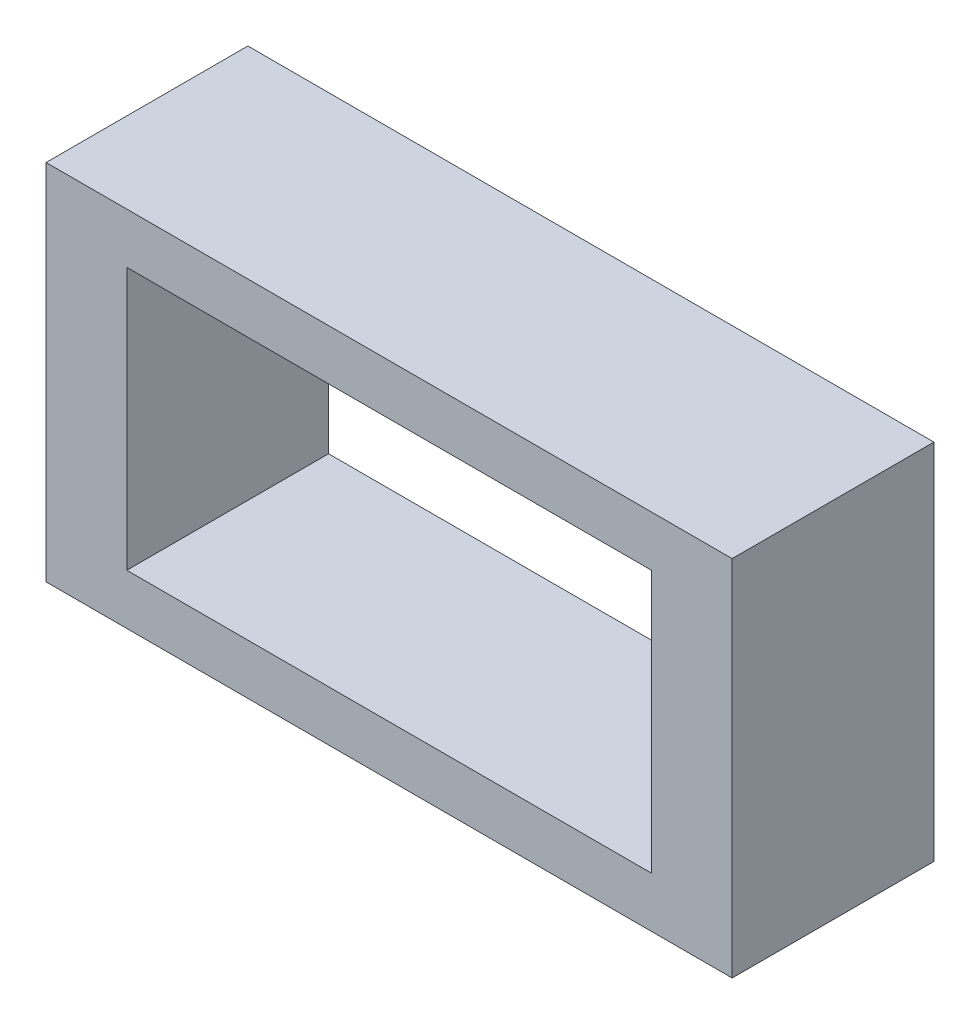
ISO-10303-21;
HEADER;
FILE_DESCRIPTION(('STEP AP214'),'2;1');
FILE_NAME('part.step','',(''),(''),'','','');
FILE_SCHEMA(('AUTOMOTIVE_DESIGN { 1 0 10303 214 1 1 1 1 }'));
ENDSEC;
DATA;
#1=APPLICATION_CONTEXT('core data for automotive mechanical design processes');
#2=APPLICATION_PROTOCOL_DEFINITION('international standard','automotive_design',2000,#1);
#3=PRODUCT_CONTEXT('',#1,'mechanical');
#4=PRODUCT('Part','Part','',(#3));
#5=PRODUCT_RELATED_PRODUCT_CATEGORY('part','',(#4));
#6=PRODUCT_DEFINITION_FORMATION('','',#4);
#7=PRODUCT_DEFINITION_CONTEXT('part definition',#1,'design');
#8=PRODUCT_DEFINITION('design','',#6,#7);
#9=PRODUCT_DEFINITION_SHAPE('','',#8);
#10=(LENGTH_UNIT() NAMED_UNIT(*) SI_UNIT(.MILLI.,.METRE.));
#11=(NAMED_UNIT(*) PLANE_ANGLE_UNIT() SI_UNIT($,.RADIAN.));
#12=(NAMED_UNIT(*) SI_UNIT($,.STERADIAN.) SOLID_ANGLE_UNIT());
#13=UNCERTAINTY_MEASURE_WITH_UNIT(LENGTH_MEASURE(1.E-05),#10,'distance_accuracy_value','');
#14=(GEOMETRIC_REPRESENTATION_CONTEXT(3) GLOBAL_UNCERTAINTY_ASSIGNED_CONTEXT((#13)) GLOBAL_UNIT_ASSIGNED_CONTEXT((#10,
#11,#12)) REPRESENTATION_CONTEXT('',''));
#15=CARTESIAN_POINT('',(0.,0.,0.));
#16=DIRECTION('',(0.,0.,1.));
#17=DIRECTION('',(1.,0.,0.));
#18=AXIS2_PLACEMENT_3D('',#15,#16,#17);
#19=CARTESIAN_POINT('',(8.5,4.5,5.));
#20=DIRECTION('',(-1.,0.,0.));
#21=DIRECTION('',(0.,-1.,0.));
#22=AXIS2_PLACEMENT_3D('',#19,#20,#21);
#23=PLANE('',#22);
#24=DIRECTION('',(0.,1.,0.));
#25=VECTOR('',#24,1.);
#26=CARTESIAN_POINT('',(8.5,4.5,0.));
#27=LINE('',#26,#25);
#28=CARTESIAN_POINT('',(8.50000000000001,-4.5,0.));
#29=VERTEX_POINT('',#28);
#30=CARTESIAN_POINT('',(8.5,4.5,0.));
#31=VERTEX_POINT('',#30);
#32=EDGE_CURVE('E129',#29,#31,#27,.T.);
#33=ORIENTED_EDGE('',*,*,#32,.T.);
#34=DIRECTION('',(0.,0.,-1.));
#35=VECTOR('',#34,1.);
#36=CARTESIAN_POINT('',(8.5,4.5,5.));
#37=LINE('',#36,#35);
#38=CARTESIAN_POINT('',(8.5,4.5,5.));
#39=VERTEX_POINT('',#38);
#40=EDGE_CURVE('E11',#39,#31,#37,.T.);
#41=ORIENTED_EDGE('',*,*,#40,.F.);
#42=DIRECTION('',(0.,1.,0.));
#43=VECTOR('',#42,1.);
#44=CARTESIAN_POINT('',(8.5,4.5,5.));
#45=LINE('',#44,#43);
#46=CARTESIAN_POINT('',(8.50000000000001,-4.5,5.));
#47=VERTEX_POINT('',#46);
#48=EDGE_CURVE('E131',#47,#39,#45,.T.);
#49=ORIENTED_EDGE('',*,*,#48,.F.);
#50=DIRECTION('',(0.,0.,-1.));
#51=VECTOR('',#50,1.);
#52=CARTESIAN_POINT('',(8.50000000000001,-4.5,5.));
#53=LINE('',#52,#51);
#54=EDGE_CURVE('E141',#47,#29,#53,.T.);
#55=ORIENTED_EDGE('',*,*,#54,.T.);
#56=EDGE_LOOP('',(#33,#41,#49,#55));
#57=FACE_BOUND('',#56,.T.);
#58=ADVANCED_FACE('F35',(#57),#23,.F.);
#59=CARTESIAN_POINT('',(-8.5,4.5,5.));
#60=DIRECTION('',(0.,-1.,0.));
#61=DIRECTION('',(0.,0.,-1.));
#62=AXIS2_PLACEMENT_3D('',#59,#60,#61);
#63=PLANE('',#62);
#64=DIRECTION('',(-1.,0.,0.));
#65=VECTOR('',#64,1.);
#66=CARTESIAN_POINT('',(-8.5,4.5,0.));
#67=LINE('',#66,#65);
#68=CARTESIAN_POINT('',(-8.5,4.5,0.));
#69=VERTEX_POINT('',#68);
#70=EDGE_CURVE('E144',#31,#69,#67,.T.);
#71=ORIENTED_EDGE('',*,*,#70,.T.);
#72=DIRECTION('',(0.,0.,-1.));
#73=VECTOR('',#72,1.);
#74=CARTESIAN_POINT('',(-8.5,4.5,5.));
#75=LINE('',#74,#73);
#76=CARTESIAN_POINT('',(-8.5,4.5,5.));
#77=VERTEX_POINT('',#76);
#78=EDGE_CURVE('E42',#77,#69,#75,.T.);
#79=ORIENTED_EDGE('',*,*,#78,.F.);
#80=DIRECTION('',(-1.,0.,0.));
#81=VECTOR('',#80,1.);
#82=CARTESIAN_POINT('',(-8.5,4.5,5.));
#83=LINE('',#82,#81);
#84=EDGE_CURVE('E134',#39,#77,#83,.T.);
#85=ORIENTED_EDGE('',*,*,#84,.F.);
#86=ORIENTED_EDGE('',*,*,#40,.T.);
#87=EDGE_LOOP('',(#71,#79,#85,#86));
#88=FACE_BOUND('',#87,.T.);
#89=ADVANCED_FACE('F172',(#88),#63,.F.);
#90=CARTESIAN_POINT('',(-8.5,4.5,5.));
#91=DIRECTION('',(1.,0.,0.));
#92=DIRECTION('',(0.,1.,0.));
#93=AXIS2_PLACEMENT_3D('',#90,#91,#92);
#94=PLANE('',#93);
#95=DIRECTION('',(0.,-1.,0.));
#96=VECTOR('',#95,1.);
#97=CARTESIAN_POINT('',(-8.5,4.5,0.));
#98=LINE('',#97,#96);
#99=CARTESIAN_POINT('',(-8.49999999999999,-4.5,0.));
#100=VERTEX_POINT('',#99);
#101=EDGE_CURVE('E146',#69,#100,#98,.T.);
#102=ORIENTED_EDGE('',*,*,#101,.T.);
#103=DIRECTION('',(0.,0.,-1.));
#104=VECTOR('',#103,1.);
#105=CARTESIAN_POINT('',(-8.49999999999999,-4.5,5.));
#106=LINE('',#105,#104);
#107=CARTESIAN_POINT('',(-8.49999999999999,-4.5,5.));
#108=VERTEX_POINT('',#107);
#109=EDGE_CURVE('E151',#108,#100,#106,.T.);
#110=ORIENTED_EDGE('',*,*,#109,.F.);
#111=DIRECTION('',(0.,-1.,0.));
#112=VECTOR('',#111,1.);
#113=CARTESIAN_POINT('',(-8.5,4.5,5.));
#114=LINE('',#113,#112);
#115=EDGE_CURVE('E137',#77,#108,#114,.T.);
#116=ORIENTED_EDGE('',*,*,#115,.F.);
#117=ORIENTED_EDGE('',*,*,#78,.T.);
#118=EDGE_LOOP('',(#102,#110,#116,#117));
#119=FACE_BOUND('',#118,.T.);
#120=ADVANCED_FACE('F158',(#119),#94,.F.);
#121=CARTESIAN_POINT('',(-8.49999999999999,-4.5,5.));
#122=DIRECTION('',(0.,1.,0.));
#123=DIRECTION('',(0.,0.,1.));
#124=AXIS2_PLACEMENT_3D('',#121,#122,#123);
#125=PLANE('',#124);
#126=DIRECTION('',(1.,0.,0.));
#127=VECTOR('',#126,1.);
#128=CARTESIAN_POINT('',(-8.49999999999999,-4.5,0.));
#129=LINE('',#128,#127);
#130=EDGE_CURVE('E135',#100,#29,#129,.T.);
#131=ORIENTED_EDGE('',*,*,#130,.T.);
#132=ORIENTED_EDGE('',*,*,#54,.F.);
#133=DIRECTION('',(1.,0.,0.));
#134=VECTOR('',#133,1.);
#135=CARTESIAN_POINT('',(-8.49999999999999,-4.5,5.));
#136=LINE('',#135,#134);
#137=EDGE_CURVE('E139',#108,#47,#136,.T.);
#138=ORIENTED_EDGE('',*,*,#137,.F.);
#139=ORIENTED_EDGE('',*,*,#109,.T.);
#140=EDGE_LOOP('',(#131,#132,#138,#139));
#141=FACE_BOUND('',#140,.T.);
#142=ADVANCED_FACE('F167',(#141),#125,.F.);
#143=CARTESIAN_POINT('',(0.,0.,5.));
#144=DIRECTION('',(0.,0.,1.));
#145=DIRECTION('',(1.,0.,0.));
#146=AXIS2_PLACEMENT_3D('',#143,#144,#145);
#147=PLANE('',#146);
#148=DIRECTION('',(0.,-1.,0.));
#149=VECTOR('',#148,1.);
#150=CARTESIAN_POINT('',(-6.5,3.25,5.));
#151=LINE('',#150,#149);
#152=CARTESIAN_POINT('',(-6.5,3.25,5.));
#153=VERTEX_POINT('',#152);
#154=CARTESIAN_POINT('',(-6.5,-3.25,5.));
#155=VERTEX_POINT('',#154);
#156=EDGE_CURVE('E49',#153,#155,#151,.T.);
#157=ORIENTED_EDGE('',*,*,#156,.F.);
#158=DIRECTION('',(1.,0.,0.));
#159=VECTOR('',#158,1.);
#160=CARTESIAN_POINT('',(-6.5,3.25,5.));
#161=LINE('',#160,#159);
#162=CARTESIAN_POINT('',(6.5,3.25,5.));
#163=VERTEX_POINT('',#162);
#164=EDGE_CURVE('E118',#153,#163,#161,.T.);
#165=ORIENTED_EDGE('',*,*,#164,.T.);
#166=DIRECTION('',(0.,-1.,0.));
#167=VECTOR('',#166,1.);
#168=CARTESIAN_POINT('',(6.5,3.25,5.));
#169=LINE('',#168,#167);
#170=CARTESIAN_POINT('',(6.5,-3.25,5.));
#171=VERTEX_POINT('',#170);
#172=EDGE_CURVE('E102',#163,#171,#169,.T.);
#173=ORIENTED_EDGE('',*,*,#172,.T.);
#174=DIRECTION('',(1.,0.,0.));
#175=VECTOR('',#174,1.);
#176=CARTESIAN_POINT('',(-6.5,-3.25,5.));
#177=LINE('',#176,#175);
#178=EDGE_CURVE('E111',#155,#171,#177,.T.);
#179=ORIENTED_EDGE('',*,*,#178,.F.);
#180=EDGE_LOOP('',(#157,#165,#173,#179));
#181=FACE_BOUND('',#180,.T.);
#182=ORIENTED_EDGE('',*,*,#48,.T.);
#183=ORIENTED_EDGE('',*,*,#84,.T.);
#184=ORIENTED_EDGE('',*,*,#115,.T.);
#185=ORIENTED_EDGE('',*,*,#137,.T.);
#186=EDGE_LOOP('',(#182,#183,#184,#185));
#187=FACE_BOUND('',#186,.T.);
#188=ADVANCED_FACE('F115',(#181,#187),#147,.T.);
#189=CARTESIAN_POINT('',(0.,0.,0.));
#190=DIRECTION('',(0.,0.,1.));
#191=DIRECTION('',(1.,0.,0.));
#192=AXIS2_PLACEMENT_3D('',#189,#190,#191);
#193=PLANE('',#192);
#194=DIRECTION('',(-1.,0.,0.));
#195=VECTOR('',#194,1.);
#196=CARTESIAN_POINT('',(-6.5,3.25,0.));
#197=LINE('',#196,#195);
#198=CARTESIAN_POINT('',(6.5,3.25,0.));
#199=VERTEX_POINT('',#198);
#200=CARTESIAN_POINT('',(-6.5,3.25,0.));
#201=VERTEX_POINT('',#200);
#202=EDGE_CURVE('E201',#199,#201,#197,.T.);
#203=ORIENTED_EDGE('',*,*,#202,.T.);
#204=DIRECTION('',(0.,1.,0.));
#205=VECTOR('',#204,1.);
#206=CARTESIAN_POINT('',(-6.5,3.25,0.));
#207=LINE('',#206,#205);
#208=CARTESIAN_POINT('',(-6.5,-3.25,0.));
#209=VERTEX_POINT('',#208);
#210=EDGE_CURVE('E130',#209,#201,#207,.T.);
#211=ORIENTED_EDGE('',*,*,#210,.F.);
#212=DIRECTION('',(-1.,0.,0.));
#213=VECTOR('',#212,1.);
#214=CARTESIAN_POINT('',(-6.5,-3.25,0.));
#215=LINE('',#214,#213);
#216=CARTESIAN_POINT('',(6.5,-3.25,0.));
#217=VERTEX_POINT('',#216);
#218=EDGE_CURVE('E127',#217,#209,#215,.T.);
#219=ORIENTED_EDGE('',*,*,#218,.F.);
#220=DIRECTION('',(0.,1.,0.));
#221=VECTOR('',#220,1.);
#222=CARTESIAN_POINT('',(6.5,3.25,0.));
#223=LINE('',#222,#221);
#224=EDGE_CURVE('E105',#217,#199,#223,.T.);
#225=ORIENTED_EDGE('',*,*,#224,.T.);
#226=EDGE_LOOP('',(#203,#211,#219,#225));
#227=FACE_BOUND('',#226,.T.);
#228=ORIENTED_EDGE('',*,*,#32,.F.);
#229=ORIENTED_EDGE('',*,*,#130,.F.);
#230=ORIENTED_EDGE('',*,*,#101,.F.);
#231=ORIENTED_EDGE('',*,*,#70,.F.);
#232=EDGE_LOOP('',(#228,#229,#230,#231));
#233=FACE_BOUND('',#232,.T.);
#234=ADVANCED_FACE('F164',(#227,#233),#193,.F.);
#235=CARTESIAN_POINT('',(-6.5,3.25,-14.5344418537486));
#236=DIRECTION('',(-1.,0.,0.));
#237=DIRECTION('',(0.,-1.,0.));
#238=AXIS2_PLACEMENT_3D('',#235,#236,#237);
#239=PLANE('',#238);
#240=ORIENTED_EDGE('',*,*,#210,.T.);
#241=DIRECTION('',(0.,0.,1.));
#242=VECTOR('',#241,1.);
#243=CARTESIAN_POINT('',(-6.5,3.25,-14.5344418537486));
#244=LINE('',#243,#242);
#245=EDGE_CURVE('E123',#201,#153,#244,.T.);
#246=ORIENTED_EDGE('',*,*,#245,.T.);
#247=ORIENTED_EDGE('',*,*,#156,.T.);
#248=DIRECTION('',(0.,0.,1.));
#249=VECTOR('',#248,1.);
#250=CARTESIAN_POINT('',(-6.5,-3.25,-14.5344418537486));
#251=LINE('',#250,#249);
#252=EDGE_CURVE('E108',#209,#155,#251,.T.);
#253=ORIENTED_EDGE('',*,*,#252,.F.);
#254=EDGE_LOOP('',(#240,#246,#247,#253));
#255=FACE_BOUND('',#254,.T.);
#256=ADVANCED_FACE('F184',(#255),#239,.F.);
#257=CARTESIAN_POINT('',(-6.5,3.25,-14.5344418537486));
#258=DIRECTION('',(0.,-1.,0.));
#259=DIRECTION('',(0.,0.,-1.));
#260=AXIS2_PLACEMENT_3D('',#257,#258,#259);
#261=PLANE('',#260);
#262=DIRECTION('',(0.,0.,1.));
#263=VECTOR('',#262,1.);
#264=CARTESIAN_POINT('',(6.5,3.25,-14.5344418537486));
#265=LINE('',#264,#263);
#266=EDGE_CURVE('E107',#199,#163,#265,.T.);
#267=ORIENTED_EDGE('',*,*,#266,.T.);
#268=ORIENTED_EDGE('',*,*,#164,.F.);
#269=ORIENTED_EDGE('',*,*,#245,.F.);
#270=ORIENTED_EDGE('',*,*,#202,.F.);
#271=EDGE_LOOP('',(#267,#268,#269,#270));
#272=FACE_BOUND('',#271,.T.);
#273=ADVANCED_FACE('F190',(#272),#261,.T.);
#274=CARTESIAN_POINT('',(6.5,3.25,-14.5344418537486));
#275=DIRECTION('',(-1.,0.,0.));
#276=DIRECTION('',(0.,-1.,0.));
#277=AXIS2_PLACEMENT_3D('',#274,#275,#276);
#278=PLANE('',#277);
#279=DIRECTION('',(0.,0.,1.));
#280=VECTOR('',#279,1.);
#281=CARTESIAN_POINT('',(6.5,-3.25,-14.5344418537486));
#282=LINE('',#281,#280);
#283=EDGE_CURVE('E57',#217,#171,#282,.T.);
#284=ORIENTED_EDGE('',*,*,#283,.T.);
#285=ORIENTED_EDGE('',*,*,#172,.F.);
#286=ORIENTED_EDGE('',*,*,#266,.F.);
#287=ORIENTED_EDGE('',*,*,#224,.F.);
#288=EDGE_LOOP('',(#284,#285,#286,#287));
#289=FACE_BOUND('',#288,.T.);
#290=ADVANCED_FACE('F99',(#289),#278,.T.);
#291=CARTESIAN_POINT('',(-6.5,-3.25,-14.5344418537486));
#292=DIRECTION('',(0.,-1.,0.));
#293=DIRECTION('',(0.,0.,-1.));
#294=AXIS2_PLACEMENT_3D('',#291,#292,#293);
#295=PLANE('',#294);
#296=ORIENTED_EDGE('',*,*,#218,.T.);
#297=ORIENTED_EDGE('',*,*,#252,.T.);
#298=ORIENTED_EDGE('',*,*,#178,.T.);
#299=ORIENTED_EDGE('',*,*,#283,.F.);
#300=EDGE_LOOP('',(#296,#297,#298,#299));
#301=FACE_BOUND('',#300,.T.);
#302=ADVANCED_FACE('F112',(#301),#295,.F.);
#303=CLOSED_SHELL('',(#58,#89,#120,#142,#188,#234,#256,#273,#290,#302));
#304=MANIFOLD_SOLID_BREP('B2',#303);
#305=ADVANCED_BREP_SHAPE_REPRESENTATION('',(#18,#304),#14);
#306=SHAPE_DEFINITION_REPRESENTATION(#9,#305);
ENDSEC;
END-ISO-10303-21;
